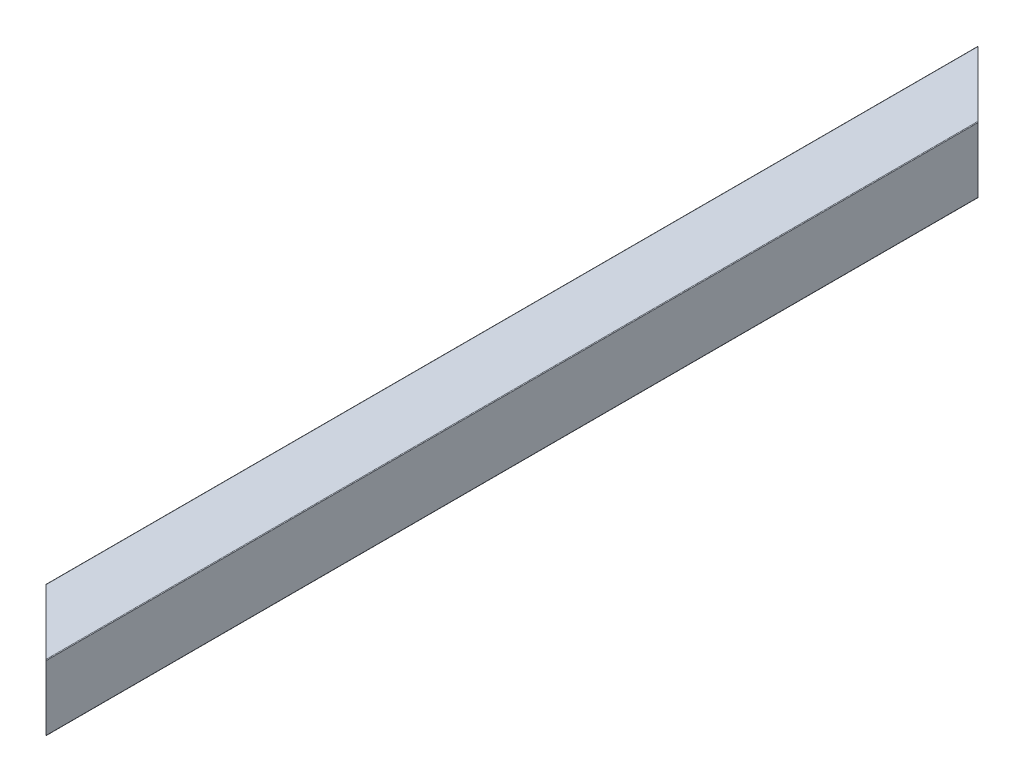
ISO-10303-21;
HEADER;
FILE_DESCRIPTION(('STEP AP214'),'2;1');
FILE_NAME('part.step','',(''),(''),'','','');
FILE_SCHEMA(('AUTOMOTIVE_DESIGN { 1 0 10303 214 1 1 1 1 }'));
ENDSEC;
DATA;
#1=APPLICATION_CONTEXT('core data for automotive mechanical design processes');
#2=APPLICATION_PROTOCOL_DEFINITION('international standard','automotive_design',2000,#1);
#3=PRODUCT_CONTEXT('',#1,'mechanical');
#4=PRODUCT('Part','Part','',(#3));
#5=PRODUCT_RELATED_PRODUCT_CATEGORY('part','',(#4));
#6=PRODUCT_DEFINITION_FORMATION('','',#4);
#7=PRODUCT_DEFINITION_CONTEXT('part definition',#1,'design');
#8=PRODUCT_DEFINITION('design','',#6,#7);
#9=PRODUCT_DEFINITION_SHAPE('','',#8);
#10=(LENGTH_UNIT() NAMED_UNIT(*) SI_UNIT(.MILLI.,.METRE.));
#11=(NAMED_UNIT(*) PLANE_ANGLE_UNIT() SI_UNIT($,.RADIAN.));
#12=(NAMED_UNIT(*) SI_UNIT($,.STERADIAN.) SOLID_ANGLE_UNIT());
#13=UNCERTAINTY_MEASURE_WITH_UNIT(LENGTH_MEASURE(1.E-05),#10,'distance_accuracy_value','');
#14=(GEOMETRIC_REPRESENTATION_CONTEXT(3) GLOBAL_UNCERTAINTY_ASSIGNED_CONTEXT((#13)) GLOBAL_UNIT_ASSIGNED_CONTEXT((#10,
#11,#12)) REPRESENTATION_CONTEXT('',''));
#15=CARTESIAN_POINT('',(0.,0.,0.));
#16=DIRECTION('',(0.,0.,1.));
#17=DIRECTION('',(1.,0.,0.));
#18=AXIS2_PLACEMENT_3D('',#15,#16,#17);
#19=CARTESIAN_POINT('',(3.175,4.7625,1828.8));
#20=DIRECTION('',(1.,0.,0.));
#21=DIRECTION('',(0.,1.,0.));
#22=AXIS2_PLACEMENT_3D('',#19,#20,#21);
#23=PLANE('',#22);
#24=DIRECTION('',(0.,1.,0.));
#25=VECTOR('',#24,1.);
#26=CARTESIAN_POINT('',(3.175,4.7625,1806.575));
#27=LINE('',#26,#25);
#28=CARTESIAN_POINT('',(3.175,4.7625,1806.575));
#29=VERTEX_POINT('',#28);
#30=CARTESIAN_POINT('',(3.175,20.6375,1806.575));
#31=VERTEX_POINT('',#30);
#32=EDGE_CURVE('E307',#29,#31,#27,.T.);
#33=ORIENTED_EDGE('',*,*,#32,.F.);
#34=DIRECTION('',(0.,0.,-1.));
#35=VECTOR('',#34,1.);
#36=CARTESIAN_POINT('',(3.175,4.7625,1828.8));
#37=LINE('',#36,#35);
#38=CARTESIAN_POINT('',(3.175,4.7625,1447.419));
#39=VERTEX_POINT('',#38);
#40=EDGE_CURVE('E67',#29,#39,#37,.T.);
#41=ORIENTED_EDGE('',*,*,#40,.T.);
#42=DIRECTION('',(0.,-1.,0.));
#43=VECTOR('',#42,1.);
#44=CARTESIAN_POINT('',(3.175,4.7625,1447.419));
#45=LINE('',#44,#43);
#46=CARTESIAN_POINT('',(3.175,20.6375,1447.419));
#47=VERTEX_POINT('',#46);
#48=EDGE_CURVE('E255',#47,#39,#45,.T.);
#49=ORIENTED_EDGE('',*,*,#48,.F.);
#50=DIRECTION('',(0.,0.,-1.));
#51=VECTOR('',#50,1.);
#52=CARTESIAN_POINT('',(3.175,20.6375,1828.8));
#53=LINE('',#52,#51);
#54=EDGE_CURVE('E11',#31,#47,#53,.T.);
#55=ORIENTED_EDGE('',*,*,#54,.F.);
#56=EDGE_LOOP('',(#33,#41,#49,#55));
#57=FACE_BOUND('',#56,.T.);
#58=ADVANCED_FACE('F42',(#57),#23,.T.);
#59=CARTESIAN_POINT('',(4.7625,20.6375,1828.8));
#60=DIRECTION('',(0.,0.,-1.));
#61=DIRECTION('',(-1.,0.,0.));
#62=AXIS2_PLACEMENT_3D('',#59,#60,#61);
#63=CYLINDRICAL_SURFACE('',#62,1.5875);
#64=DIRECTION('',(0.,0.,-1.));
#65=VECTOR('',#64,1.);
#66=CARTESIAN_POINT('',(4.7625,22.225,1828.8));
#67=LINE('',#66,#65);
#68=CARTESIAN_POINT('',(4.7625,22.225,1808.1625));
#69=VERTEX_POINT('',#68);
#70=CARTESIAN_POINT('',(4.7625,22.225,1449.0065));
#71=VERTEX_POINT('',#70);
#72=EDGE_CURVE('E51',#69,#71,#67,.T.);
#73=ORIENTED_EDGE('',*,*,#72,.F.);
#74=CARTESIAN_POINT('',(4.7625,20.6375,1808.1625));
#75=DIRECTION('',(0.707106781186545,0.,-0.70710678118655));
#76=DIRECTION('',(-0.70710678118655,0.,-0.707106781186545));
#77=AXIS2_PLACEMENT_3D('',#74,#75,#76);
#78=ELLIPSE('',#77,2.24506403026728,1.5875);
#79=EDGE_CURVE('E300',#69,#31,#78,.F.);
#80=ORIENTED_EDGE('',*,*,#79,.T.);
#81=ORIENTED_EDGE('',*,*,#54,.T.);
#82=CARTESIAN_POINT('',(4.7625,20.6375,1449.0065));
#83=DIRECTION('',(-0.707106781186545,0.,0.70710678118655));
#84=DIRECTION('',(-0.70710678118655,0.,-0.707106781186545));
#85=AXIS2_PLACEMENT_3D('',#82,#83,#84);
#86=ELLIPSE('',#85,2.24506403026728,1.5875);
#87=EDGE_CURVE('E248',#47,#71,#86,.F.);
#88=ORIENTED_EDGE('',*,*,#87,.T.);
#89=EDGE_LOOP('',(#73,#80,#81,#88));
#90=FACE_BOUND('',#89,.T.);
#91=ADVANCED_FACE('F253',(#90),#63,.F.);
#92=CARTESIAN_POINT('',(4.7625,22.225,1828.8));
#93=DIRECTION('',(0.,-1.,0.));
#94=DIRECTION('',(0.,0.,-1.));
#95=AXIS2_PLACEMENT_3D('',#92,#93,#94);
#96=PLANE('',#95);
#97=DIRECTION('',(0.70710678118655,0.,0.707106781186545));
#98=VECTOR('',#97,1.);
#99=CARTESIAN_POINT('',(15.08125,22.225,1818.48125));
#100=LINE('',#99,#98);
#101=CARTESIAN_POINT('',(20.6375,22.225,1824.0375));
#102=VERTEX_POINT('',#101);
#103=EDGE_CURVE('E239',#69,#102,#100,.T.);
#104=ORIENTED_EDGE('',*,*,#103,.F.);
#105=ORIENTED_EDGE('',*,*,#72,.T.);
#106=DIRECTION('',(-0.70710678118655,0.,-0.707106781186545));
#107=VECTOR('',#106,1.);
#108=CARTESIAN_POINT('',(194.65925,22.225,1638.90325));
#109=LINE('',#108,#107);
#110=CARTESIAN_POINT('',(20.6375,22.225,1464.8815));
#111=VERTEX_POINT('',#110);
#112=EDGE_CURVE('E238',#111,#71,#109,.T.);
#113=ORIENTED_EDGE('',*,*,#112,.F.);
#114=DIRECTION('',(0.,0.,-1.));
#115=VECTOR('',#114,1.);
#116=CARTESIAN_POINT('',(20.6375,22.225,1828.8));
#117=LINE('',#116,#115);
#118=EDGE_CURVE('E229',#102,#111,#117,.T.);
#119=ORIENTED_EDGE('',*,*,#118,.F.);
#120=EDGE_LOOP('',(#104,#105,#113,#119));
#121=FACE_BOUND('',#120,.T.);
#122=ADVANCED_FACE('F236',(#121),#96,.T.);
#123=CARTESIAN_POINT('',(20.6375,20.6375,1828.8));
#124=DIRECTION('',(0.,0.,-1.));
#125=DIRECTION('',(-1.,0.,0.));
#126=AXIS2_PLACEMENT_3D('',#123,#124,#125);
#127=CYLINDRICAL_SURFACE('',#126,1.5875);
#128=DIRECTION('',(0.,0.,-1.));
#129=VECTOR('',#128,1.);
#130=CARTESIAN_POINT('',(22.225,20.6375,1828.8));
#131=LINE('',#130,#129);
#132=CARTESIAN_POINT('',(22.225,20.6375,1825.625));
#133=VERTEX_POINT('',#132);
#134=CARTESIAN_POINT('',(22.225,20.6375,1466.469));
#135=VERTEX_POINT('',#134);
#136=EDGE_CURVE('E190',#133,#135,#131,.T.);
#137=ORIENTED_EDGE('',*,*,#136,.F.);
#138=CARTESIAN_POINT('',(20.6375,20.6375,1824.0375));
#139=DIRECTION('',(0.707106781186545,0.,-0.70710678118655));
#140=DIRECTION('',(-0.70710678118655,0.,-0.707106781186545));
#141=AXIS2_PLACEMENT_3D('',#138,#139,#140);
#142=ELLIPSE('',#141,2.24506403026728,1.5875);
#143=EDGE_CURVE('E296',#133,#102,#142,.F.);
#144=ORIENTED_EDGE('',*,*,#143,.T.);
#145=ORIENTED_EDGE('',*,*,#118,.T.);
#146=CARTESIAN_POINT('',(20.6375,20.6375,1464.8815));
#147=DIRECTION('',(-0.707106781186545,0.,0.70710678118655));
#148=DIRECTION('',(-0.70710678118655,0.,-0.707106781186545));
#149=AXIS2_PLACEMENT_3D('',#146,#147,#148);
#150=ELLIPSE('',#149,2.24506403026728,1.5875);
#151=EDGE_CURVE('E251',#111,#135,#150,.F.);
#152=ORIENTED_EDGE('',*,*,#151,.T.);
#153=EDGE_LOOP('',(#137,#144,#145,#152));
#154=FACE_BOUND('',#153,.T.);
#155=ADVANCED_FACE('F294',(#154),#127,.F.);
#156=CARTESIAN_POINT('',(22.225,4.7625,1828.8));
#157=DIRECTION('',(-1.,0.,0.));
#158=DIRECTION('',(0.,0.,1.));
#159=AXIS2_PLACEMENT_3D('',#156,#157,#158);
#160=PLANE('',#159);
#161=DIRECTION('',(0.,-1.,0.));
#162=VECTOR('',#161,1.);
#163=CARTESIAN_POINT('',(22.225,4.7625,1825.625));
#164=LINE('',#163,#162);
#165=CARTESIAN_POINT('',(22.225,4.7625,1825.625));
#166=VERTEX_POINT('',#165);
#167=EDGE_CURVE('E298',#133,#166,#164,.T.);
#168=ORIENTED_EDGE('',*,*,#167,.F.);
#169=ORIENTED_EDGE('',*,*,#136,.T.);
#170=DIRECTION('',(0.,1.,0.));
#171=VECTOR('',#170,1.);
#172=CARTESIAN_POINT('',(22.225,4.7625,1466.469));
#173=LINE('',#172,#171);
#174=CARTESIAN_POINT('',(22.225,4.7625,1466.469));
#175=VERTEX_POINT('',#174);
#176=EDGE_CURVE('E291',#175,#135,#173,.T.);
#177=ORIENTED_EDGE('',*,*,#176,.F.);
#178=DIRECTION('',(0.,0.,-1.));
#179=VECTOR('',#178,1.);
#180=CARTESIAN_POINT('',(22.225,4.7625,1828.8));
#181=LINE('',#180,#179);
#182=EDGE_CURVE('E198',#166,#175,#181,.T.);
#183=ORIENTED_EDGE('',*,*,#182,.F.);
#184=EDGE_LOOP('',(#168,#169,#177,#183));
#185=FACE_BOUND('',#184,.T.);
#186=ADVANCED_FACE('F335',(#185),#160,.T.);
#187=CARTESIAN_POINT('',(20.6375,4.7625,1828.8));
#188=DIRECTION('',(0.,0.,-1.));
#189=DIRECTION('',(-1.,0.,0.));
#190=AXIS2_PLACEMENT_3D('',#187,#188,#189);
#191=CYLINDRICAL_SURFACE('',#190,1.5875);
#192=DIRECTION('',(0.,0.,-1.));
#193=VECTOR('',#192,1.);
#194=CARTESIAN_POINT('',(20.6375,3.175,1828.8));
#195=LINE('',#194,#193);
#196=CARTESIAN_POINT('',(20.6375,3.175,1824.0375));
#197=VERTEX_POINT('',#196);
#198=CARTESIAN_POINT('',(20.6375,3.175,1464.8815));
#199=VERTEX_POINT('',#198);
#200=EDGE_CURVE('E197',#197,#199,#195,.T.);
#201=ORIENTED_EDGE('',*,*,#200,.F.);
#202=CARTESIAN_POINT('',(20.6375,4.7625,1824.0375));
#203=DIRECTION('',(0.707106781186545,0.,-0.70710678118655));
#204=DIRECTION('',(-0.70710678118655,0.,-0.707106781186545));
#205=AXIS2_PLACEMENT_3D('',#202,#203,#204);
#206=ELLIPSE('',#205,2.24506403026728,1.5875);
#207=EDGE_CURVE('E302',#197,#166,#206,.F.);
#208=ORIENTED_EDGE('',*,*,#207,.T.);
#209=ORIENTED_EDGE('',*,*,#182,.T.);
#210=CARTESIAN_POINT('',(20.6375,4.7625,1464.8815));
#211=DIRECTION('',(-0.707106781186545,0.,0.70710678118655));
#212=DIRECTION('',(-0.70710678118655,0.,-0.707106781186545));
#213=AXIS2_PLACEMENT_3D('',#210,#211,#212);
#214=ELLIPSE('',#213,2.24506403026728,1.5875);
#215=EDGE_CURVE('E288',#175,#199,#214,.F.);
#216=ORIENTED_EDGE('',*,*,#215,.T.);
#217=EDGE_LOOP('',(#201,#208,#209,#216));
#218=FACE_BOUND('',#217,.T.);
#219=ADVANCED_FACE('F331',(#218),#191,.F.);
#220=CARTESIAN_POINT('',(4.7625,3.175,1828.8));
#221=DIRECTION('',(0.,1.,0.));
#222=DIRECTION('',(1.,0.,0.));
#223=AXIS2_PLACEMENT_3D('',#220,#221,#222);
#224=PLANE('',#223);
#225=DIRECTION('',(-0.70710678118655,0.,-0.707106781186545));
#226=VECTOR('',#225,1.);
#227=CARTESIAN_POINT('',(15.08125,3.175,1818.48125));
#228=LINE('',#227,#226);
#229=CARTESIAN_POINT('',(4.7625,3.175,1808.1625));
#230=VERTEX_POINT('',#229);
#231=EDGE_CURVE('E59',#197,#230,#228,.T.);
#232=ORIENTED_EDGE('',*,*,#231,.F.);
#233=ORIENTED_EDGE('',*,*,#200,.T.);
#234=DIRECTION('',(0.70710678118655,0.,0.707106781186545));
#235=VECTOR('',#234,1.);
#236=CARTESIAN_POINT('',(194.65925,3.175,1638.90325));
#237=LINE('',#236,#235);
#238=CARTESIAN_POINT('',(4.7625,3.175,1449.0065));
#239=VERTEX_POINT('',#238);
#240=EDGE_CURVE('E286',#239,#199,#237,.T.);
#241=ORIENTED_EDGE('',*,*,#240,.F.);
#242=DIRECTION('',(0.,0.,-1.));
#243=VECTOR('',#242,1.);
#244=CARTESIAN_POINT('',(4.7625,3.175,1828.8));
#245=LINE('',#244,#243);
#246=EDGE_CURVE('E199',#230,#239,#245,.T.);
#247=ORIENTED_EDGE('',*,*,#246,.F.);
#248=EDGE_LOOP('',(#232,#233,#241,#247));
#249=FACE_BOUND('',#248,.T.);
#250=ADVANCED_FACE('F336',(#249),#224,.T.);
#251=CARTESIAN_POINT('',(4.7625,4.7625,1828.8));
#252=DIRECTION('',(0.,0.,-1.));
#253=DIRECTION('',(-1.,0.,0.));
#254=AXIS2_PLACEMENT_3D('',#251,#252,#253);
#255=CYLINDRICAL_SURFACE('',#254,1.5875);
#256=ORIENTED_EDGE('',*,*,#40,.F.);
#257=CARTESIAN_POINT('',(4.7625,4.7625,1808.1625));
#258=DIRECTION('',(0.707106781186545,0.,-0.70710678118655));
#259=DIRECTION('',(-0.70710678118655,0.,-0.707106781186545));
#260=AXIS2_PLACEMENT_3D('',#257,#258,#259);
#261=ELLIPSE('',#260,2.24506403026728,1.5875);
#262=EDGE_CURVE('E326',#29,#230,#261,.F.);
#263=ORIENTED_EDGE('',*,*,#262,.T.);
#264=ORIENTED_EDGE('',*,*,#246,.T.);
#265=CARTESIAN_POINT('',(4.7625,4.7625,1449.0065));
#266=DIRECTION('',(-0.707106781186545,0.,0.70710678118655));
#267=DIRECTION('',(-0.70710678118655,0.,-0.707106781186545));
#268=AXIS2_PLACEMENT_3D('',#265,#266,#267);
#269=ELLIPSE('',#268,2.24506403026728,1.5875);
#270=EDGE_CURVE('E284',#239,#39,#269,.F.);
#271=ORIENTED_EDGE('',*,*,#270,.T.);
#272=EDGE_LOOP('',(#256,#263,#264,#271));
#273=FACE_BOUND('',#272,.T.);
#274=ADVANCED_FACE('F338',(#273),#255,.F.);
#275=CARTESIAN_POINT('',(0.,0.254,1828.8));
#276=DIRECTION('',(1.,0.,0.));
#277=DIRECTION('',(0.,1.,0.));
#278=AXIS2_PLACEMENT_3D('',#275,#276,#277);
#279=PLANE('',#278);
#280=DIRECTION('',(0.,0.,-1.));
#281=VECTOR('',#280,1.);
#282=CARTESIAN_POINT('',(0.,0.254,1828.8));
#283=LINE('',#282,#281);
#284=CARTESIAN_POINT('',(0.,0.254,1803.4));
#285=VERTEX_POINT('',#284);
#286=CARTESIAN_POINT('',(0.,0.254,1444.244));
#287=VERTEX_POINT('',#286);
#288=EDGE_CURVE('E183',#285,#287,#283,.T.);
#289=ORIENTED_EDGE('',*,*,#288,.F.);
#290=DIRECTION('',(0.,1.,0.));
#291=VECTOR('',#290,1.);
#292=CARTESIAN_POINT('',(0.,0.254,1803.4));
#293=LINE('',#292,#291);
#294=CARTESIAN_POINT('',(0.,25.146,1803.4));
#295=VERTEX_POINT('',#294);
#296=EDGE_CURVE('E164',#285,#295,#293,.T.);
#297=ORIENTED_EDGE('',*,*,#296,.T.);
#298=DIRECTION('',(0.,0.,-1.));
#299=VECTOR('',#298,1.);
#300=CARTESIAN_POINT('',(0.,25.146,1828.8));
#301=LINE('',#300,#299);
#302=CARTESIAN_POINT('',(0.,25.1460000000001,1444.244));
#303=VERTEX_POINT('',#302);
#304=EDGE_CURVE('E196',#295,#303,#301,.T.);
#305=ORIENTED_EDGE('',*,*,#304,.T.);
#306=DIRECTION('',(0.,-1.,0.));
#307=VECTOR('',#306,1.);
#308=CARTESIAN_POINT('',(0.,0.254,1444.244));
#309=LINE('',#308,#307);
#310=EDGE_CURVE('E187',#303,#287,#309,.T.);
#311=ORIENTED_EDGE('',*,*,#310,.T.);
#312=EDGE_LOOP('',(#289,#297,#305,#311));
#313=FACE_BOUND('',#312,.T.);
#314=ADVANCED_FACE('F262',(#313),#279,.F.);
#315=CARTESIAN_POINT('',(0.254,25.146,1828.8));
#316=DIRECTION('',(0.,0.,-1.));
#317=DIRECTION('',(-1.,0.,0.));
#318=AXIS2_PLACEMENT_3D('',#315,#316,#317);
#319=CYLINDRICAL_SURFACE('',#318,0.254);
#320=CARTESIAN_POINT('',(0.254,25.146,1803.654));
#321=DIRECTION('',(0.707106781186545,0.,-0.70710678118655));
#322=DIRECTION('',(-0.70710678118655,0.,-0.707106781186545));
#323=AXIS2_PLACEMENT_3D('',#320,#321,#322);
#324=ELLIPSE('',#323,0.359210244842765,0.254);
#325=CARTESIAN_POINT('',(0.253999999999983,25.4,1803.654));
#326=VERTEX_POINT('',#325);
#327=EDGE_CURVE('E323',#326,#295,#324,.F.);
#328=ORIENTED_EDGE('',*,*,#327,.F.);
#329=DIRECTION('',(0.,0.,-1.));
#330=VECTOR('',#329,1.);
#331=CARTESIAN_POINT('',(0.254,25.4,1828.8));
#332=LINE('',#331,#330);
#333=CARTESIAN_POINT('',(0.254000000000008,25.4,1444.498));
#334=VERTEX_POINT('',#333);
#335=EDGE_CURVE('E194',#326,#334,#332,.T.);
#336=ORIENTED_EDGE('',*,*,#335,.T.);
#337=CARTESIAN_POINT('',(0.254,25.146,1444.498));
#338=DIRECTION('',(-0.707106781186545,0.,0.70710678118655));
#339=DIRECTION('',(-0.70710678118655,0.,-0.707106781186545));
#340=AXIS2_PLACEMENT_3D('',#337,#338,#339);
#341=ELLIPSE('',#340,0.359210244842765,0.254);
#342=EDGE_CURVE('E267',#303,#334,#341,.F.);
#343=ORIENTED_EDGE('',*,*,#342,.F.);
#344=ORIENTED_EDGE('',*,*,#304,.F.);
#345=EDGE_LOOP('',(#328,#336,#343,#344));
#346=FACE_BOUND('',#345,.T.);
#347=ADVANCED_FACE('F271',(#346),#319,.T.);
#348=CARTESIAN_POINT('',(0.254,25.4,1828.8));
#349=DIRECTION('',(0.,-1.,0.));
#350=DIRECTION('',(0.,0.,-1.));
#351=AXIS2_PLACEMENT_3D('',#348,#349,#350);
#352=PLANE('',#351);
#353=ORIENTED_EDGE('',*,*,#335,.F.);
#354=DIRECTION('',(-0.70710678118655,0.,-0.707106781186545));
#355=VECTOR('',#354,1.);
#356=CARTESIAN_POINT('',(34.1927663058368,25.4,1837.59276630584));
#357=LINE('',#356,#355);
#358=CARTESIAN_POINT('',(25.146,25.4,1828.546));
#359=VERTEX_POINT('',#358);
#360=EDGE_CURVE('E177',#359,#326,#357,.T.);
#361=ORIENTED_EDGE('',*,*,#360,.F.);
#362=DIRECTION('',(0.,0.,-1.));
#363=VECTOR('',#362,1.);
#364=CARTESIAN_POINT('',(25.146,25.4,1828.8));
#365=LINE('',#364,#363);
#366=CARTESIAN_POINT('',(25.146,25.4,1469.39));
#367=VERTEX_POINT('',#366);
#368=EDGE_CURVE('E192',#359,#367,#365,.T.);
#369=ORIENTED_EDGE('',*,*,#368,.T.);
#370=DIRECTION('',(0.70710678118655,0.,0.707106781186545));
#371=VECTOR('',#370,1.);
#372=CARTESIAN_POINT('',(31.4832908592826,25.4,1475.72729085928));
#373=LINE('',#372,#371);
#374=EDGE_CURVE('E309',#334,#367,#373,.T.);
#375=ORIENTED_EDGE('',*,*,#374,.F.);
#376=EDGE_LOOP('',(#353,#361,#369,#375));
#377=FACE_BOUND('',#376,.T.);
#378=ADVANCED_FACE('F365',(#377),#352,.F.);
#379=CARTESIAN_POINT('',(25.146,25.146,1828.8));
#380=DIRECTION('',(0.,0.,-1.));
#381=DIRECTION('',(-1.,0.,0.));
#382=AXIS2_PLACEMENT_3D('',#379,#380,#381);
#383=CYLINDRICAL_SURFACE('',#382,0.254);
#384=CARTESIAN_POINT('',(25.146,25.146,1828.546));
#385=DIRECTION('',(0.707106781186545,0.,-0.70710678118655));
#386=DIRECTION('',(-0.70710678118655,0.,-0.707106781186545));
#387=AXIS2_PLACEMENT_3D('',#384,#385,#386);
#388=ELLIPSE('',#387,0.359210244842765,0.254);
#389=CARTESIAN_POINT('',(25.4000000000002,25.146,1828.8));
#390=VERTEX_POINT('',#389);
#391=EDGE_CURVE('E316',#390,#359,#388,.F.);
#392=ORIENTED_EDGE('',*,*,#391,.F.);
#393=DIRECTION('',(0.,0.,-1.));
#394=VECTOR('',#393,1.);
#395=CARTESIAN_POINT('',(25.4,25.146,1828.8));
#396=LINE('',#395,#394);
#397=CARTESIAN_POINT('',(25.4,25.146,1469.644));
#398=VERTEX_POINT('',#397);
#399=EDGE_CURVE('E195',#390,#398,#396,.T.);
#400=ORIENTED_EDGE('',*,*,#399,.T.);
#401=CARTESIAN_POINT('',(25.146,25.146,1469.39));
#402=DIRECTION('',(-0.707106781186545,0.,0.70710678118655));
#403=DIRECTION('',(-0.70710678118655,0.,-0.707106781186545));
#404=AXIS2_PLACEMENT_3D('',#401,#402,#403);
#405=ELLIPSE('',#404,0.359210244842765,0.254);
#406=EDGE_CURVE('E282',#367,#398,#405,.F.);
#407=ORIENTED_EDGE('',*,*,#406,.F.);
#408=ORIENTED_EDGE('',*,*,#368,.F.);
#409=EDGE_LOOP('',(#392,#400,#407,#408));
#410=FACE_BOUND('',#409,.T.);
#411=ADVANCED_FACE('F44',(#410),#383,.T.);
#412=CARTESIAN_POINT('',(25.4,0.254,1828.8));
#413=DIRECTION('',(-1.,0.,0.));
#414=DIRECTION('',(0.,0.,1.));
#415=AXIS2_PLACEMENT_3D('',#412,#413,#414);
#416=PLANE('',#415);
#417=DIRECTION('',(0.,0.,-1.));
#418=VECTOR('',#417,1.);
#419=CARTESIAN_POINT('',(25.4,0.254,1828.8));
#420=LINE('',#419,#418);
#421=CARTESIAN_POINT('',(25.4,0.254,1828.8));
#422=VERTEX_POINT('',#421);
#423=CARTESIAN_POINT('',(25.4,0.254,1469.644));
#424=VERTEX_POINT('',#423);
#425=EDGE_CURVE('E213',#422,#424,#420,.T.);
#426=ORIENTED_EDGE('',*,*,#425,.T.);
#427=DIRECTION('',(0.,1.,0.));
#428=VECTOR('',#427,1.);
#429=CARTESIAN_POINT('',(25.4,0.254,1469.644));
#430=LINE('',#429,#428);
#431=EDGE_CURVE('E275',#424,#398,#430,.T.);
#432=ORIENTED_EDGE('',*,*,#431,.T.);
#433=ORIENTED_EDGE('',*,*,#399,.F.);
#434=DIRECTION('',(0.,1.,0.));
#435=VECTOR('',#434,1.);
#436=CARTESIAN_POINT('',(25.4,0.254,1828.8));
#437=LINE('',#436,#435);
#438=EDGE_CURVE('E46',#422,#390,#437,.T.);
#439=ORIENTED_EDGE('',*,*,#438,.F.);
#440=EDGE_LOOP('',(#426,#432,#433,#439));
#441=FACE_BOUND('',#440,.T.);
#442=ADVANCED_FACE('F317',(#441),#416,.F.);
#443=CARTESIAN_POINT('',(25.146,0.254,1828.8));
#444=DIRECTION('',(0.,0.,-1.));
#445=DIRECTION('',(-1.,0.,0.));
#446=AXIS2_PLACEMENT_3D('',#443,#444,#445);
#447=CYLINDRICAL_SURFACE('',#446,0.254);
#448=CARTESIAN_POINT('',(25.146,0.254,1828.546));
#449=DIRECTION('',(0.707106781186545,0.,-0.70710678118655));
#450=DIRECTION('',(-0.70710678118655,0.,-0.707106781186545));
#451=AXIS2_PLACEMENT_3D('',#448,#449,#450);
#452=ELLIPSE('',#451,0.359210244842765,0.254);
#453=CARTESIAN_POINT('',(25.146,0.,1828.546));
#454=VERTEX_POINT('',#453);
#455=EDGE_CURVE('E168',#454,#422,#452,.F.);
#456=ORIENTED_EDGE('',*,*,#455,.F.);
#457=DIRECTION('',(0.,0.,-1.));
#458=VECTOR('',#457,1.);
#459=CARTESIAN_POINT('',(25.146,0.,1828.8));
#460=LINE('',#459,#458);
#461=CARTESIAN_POINT('',(25.146,0.,1469.39));
#462=VERTEX_POINT('',#461);
#463=EDGE_CURVE('E176',#454,#462,#460,.T.);
#464=ORIENTED_EDGE('',*,*,#463,.T.);
#465=CARTESIAN_POINT('',(25.146,0.254,1469.39));
#466=DIRECTION('',(-0.707106781186545,0.,0.70710678118655));
#467=DIRECTION('',(-0.70710678118655,0.,-0.707106781186545));
#468=AXIS2_PLACEMENT_3D('',#465,#466,#467);
#469=ELLIPSE('',#468,0.359210244842765,0.254);
#470=EDGE_CURVE('E273',#424,#462,#469,.F.);
#471=ORIENTED_EDGE('',*,*,#470,.F.);
#472=ORIENTED_EDGE('',*,*,#425,.F.);
#473=EDGE_LOOP('',(#456,#464,#471,#472));
#474=FACE_BOUND('',#473,.T.);
#475=ADVANCED_FACE('F318',(#474),#447,.T.);
#476=CARTESIAN_POINT('',(0.254,0.,1828.8));
#477=DIRECTION('',(0.,1.,0.));
#478=DIRECTION('',(1.,0.,0.));
#479=AXIS2_PLACEMENT_3D('',#476,#477,#478);
#480=PLANE('',#479);
#481=ORIENTED_EDGE('',*,*,#463,.F.);
#482=DIRECTION('',(0.70710678118655,0.,0.707106781186545));
#483=VECTOR('',#482,1.);
#484=CARTESIAN_POINT('',(34.1927663058368,0.,1837.59276630584));
#485=LINE('',#484,#483);
#486=CARTESIAN_POINT('',(0.253999999999999,0.,1803.654));
#487=VERTEX_POINT('',#486);
#488=EDGE_CURVE('E161',#487,#454,#485,.T.);
#489=ORIENTED_EDGE('',*,*,#488,.F.);
#490=DIRECTION('',(0.,0.,-1.));
#491=VECTOR('',#490,1.);
#492=CARTESIAN_POINT('',(0.254,0.,1828.8));
#493=LINE('',#492,#491);
#494=CARTESIAN_POINT('',(0.254000000000004,0.,1444.498));
#495=VERTEX_POINT('',#494);
#496=EDGE_CURVE('E174',#487,#495,#493,.T.);
#497=ORIENTED_EDGE('',*,*,#496,.T.);
#498=DIRECTION('',(-0.70710678118655,0.,-0.707106781186545));
#499=VECTOR('',#498,1.);
#500=CARTESIAN_POINT('',(31.4832908592826,0.,1475.72729085928));
#501=LINE('',#500,#499);
#502=EDGE_CURVE('E277',#462,#495,#501,.T.);
#503=ORIENTED_EDGE('',*,*,#502,.F.);
#504=EDGE_LOOP('',(#481,#489,#497,#503));
#505=FACE_BOUND('',#504,.T.);
#506=ADVANCED_FACE('F172',(#505),#480,.F.);
#507=CARTESIAN_POINT('',(0.254,0.254,1828.8));
#508=DIRECTION('',(0.,0.,-1.));
#509=DIRECTION('',(-1.,0.,0.));
#510=AXIS2_PLACEMENT_3D('',#507,#508,#509);
#511=CYLINDRICAL_SURFACE('',#510,0.254);
#512=CARTESIAN_POINT('',(0.254,0.254,1803.654));
#513=DIRECTION('',(0.707106781186545,0.,-0.70710678118655));
#514=DIRECTION('',(-0.70710678118655,0.,-0.707106781186545));
#515=AXIS2_PLACEMENT_3D('',#512,#513,#514);
#516=ELLIPSE('',#515,0.359210244842765,0.254);
#517=EDGE_CURVE('E158',#285,#487,#516,.F.);
#518=ORIENTED_EDGE('',*,*,#517,.F.);
#519=ORIENTED_EDGE('',*,*,#288,.T.);
#520=CARTESIAN_POINT('',(0.254,0.254,1444.498));
#521=DIRECTION('',(-0.707106781186545,0.,0.70710678118655));
#522=DIRECTION('',(-0.70710678118655,0.,-0.707106781186545));
#523=AXIS2_PLACEMENT_3D('',#520,#521,#522);
#524=ELLIPSE('',#523,0.359210244842765,0.254);
#525=EDGE_CURVE('E182',#495,#287,#524,.F.);
#526=ORIENTED_EDGE('',*,*,#525,.F.);
#527=ORIENTED_EDGE('',*,*,#496,.F.);
#528=EDGE_LOOP('',(#518,#519,#526,#527));
#529=FACE_BOUND('',#528,.T.);
#530=ADVANCED_FACE('F180',(#529),#511,.T.);
#531=CARTESIAN_POINT('',(31.4832908592826,-76.1999999999998,1475.72729085928));
#532=DIRECTION('',(-0.707106781186545,0.,0.70710678118655));
#533=DIRECTION('',(0.70710678118655,0.,0.707106781186545));
#534=AXIS2_PLACEMENT_3D('',#531,#532,#533);
#535=PLANE('',#534);
#536=ORIENTED_EDGE('',*,*,#48,.T.);
#537=ORIENTED_EDGE('',*,*,#270,.F.);
#538=ORIENTED_EDGE('',*,*,#240,.T.);
#539=ORIENTED_EDGE('',*,*,#215,.F.);
#540=ORIENTED_EDGE('',*,*,#176,.T.);
#541=ORIENTED_EDGE('',*,*,#151,.F.);
#542=ORIENTED_EDGE('',*,*,#112,.T.);
#543=ORIENTED_EDGE('',*,*,#87,.F.);
#544=EDGE_LOOP('',(#536,#537,#538,#539,#540,#541,#542,#543));
#545=FACE_BOUND('',#544,.T.);
#546=ORIENTED_EDGE('',*,*,#406,.T.);
#547=ORIENTED_EDGE('',*,*,#431,.F.);
#548=ORIENTED_EDGE('',*,*,#470,.T.);
#549=ORIENTED_EDGE('',*,*,#502,.T.);
#550=ORIENTED_EDGE('',*,*,#525,.T.);
#551=ORIENTED_EDGE('',*,*,#310,.F.);
#552=ORIENTED_EDGE('',*,*,#342,.T.);
#553=ORIENTED_EDGE('',*,*,#374,.T.);
#554=EDGE_LOOP('',(#546,#547,#548,#549,#550,#551,#552,#553));
#555=FACE_BOUND('',#554,.T.);
#556=ADVANCED_FACE('F246',(#545,#555),#535,.F.);
#557=CARTESIAN_POINT('',(34.1927663058368,-76.1999999999998,1837.59276630584));
#558=DIRECTION('',(0.707106781186545,0.,-0.70710678118655));
#559=DIRECTION('',(-0.70710678118655,0.,-0.707106781186545));
#560=AXIS2_PLACEMENT_3D('',#557,#558,#559);
#561=PLANE('',#560);
#562=ORIENTED_EDGE('',*,*,#32,.T.);
#563=ORIENTED_EDGE('',*,*,#79,.F.);
#564=ORIENTED_EDGE('',*,*,#103,.T.);
#565=ORIENTED_EDGE('',*,*,#143,.F.);
#566=ORIENTED_EDGE('',*,*,#167,.T.);
#567=ORIENTED_EDGE('',*,*,#207,.F.);
#568=ORIENTED_EDGE('',*,*,#231,.T.);
#569=ORIENTED_EDGE('',*,*,#262,.F.);
#570=EDGE_LOOP('',(#562,#563,#564,#565,#566,#567,#568,#569));
#571=FACE_BOUND('',#570,.T.);
#572=ORIENTED_EDGE('',*,*,#391,.T.);
#573=ORIENTED_EDGE('',*,*,#360,.T.);
#574=ORIENTED_EDGE('',*,*,#327,.T.);
#575=ORIENTED_EDGE('',*,*,#296,.F.);
#576=ORIENTED_EDGE('',*,*,#517,.T.);
#577=ORIENTED_EDGE('',*,*,#488,.T.);
#578=ORIENTED_EDGE('',*,*,#455,.T.);
#579=ORIENTED_EDGE('',*,*,#438,.T.);
#580=EDGE_LOOP('',(#572,#573,#574,#575,#576,#577,#578,#579));
#581=FACE_BOUND('',#580,.T.);
#582=ADVANCED_FACE('F160',(#571,#581),#561,.F.);
#583=CLOSED_SHELL('',(#58,#91,#122,#155,#186,#219,#250,#274,#314,#347,#378,#411,#442,#475,#506,
#530,#556,#582));
#584=MANIFOLD_SOLID_BREP('B2',#583);
#585=ADVANCED_BREP_SHAPE_REPRESENTATION('',(#18,#584),#14);
#586=SHAPE_DEFINITION_REPRESENTATION(#9,#585);
ENDSEC;
END-ISO-10303-21;
